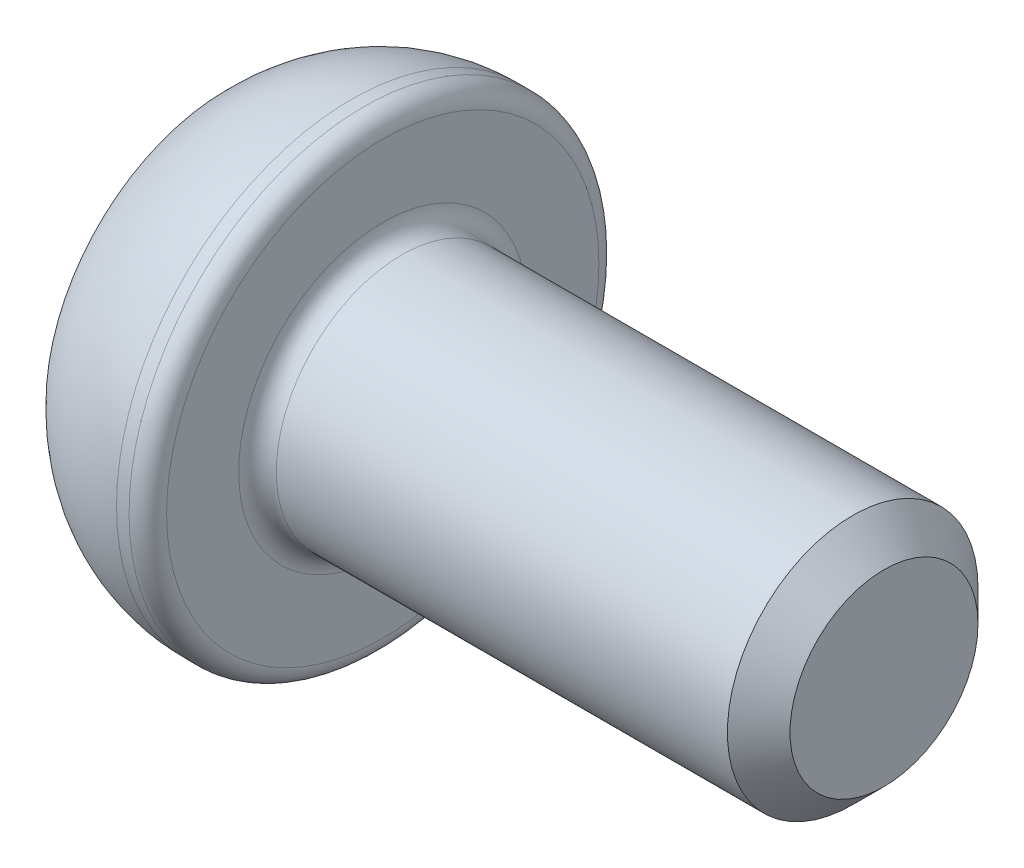
ISO-10303-21;
HEADER;
FILE_DESCRIPTION(('STEP AP214'),'2;1');
FILE_NAME('part.step','',(''),(''),'','','');
FILE_SCHEMA(('AUTOMOTIVE_DESIGN { 1 0 10303 214 1 1 1 1 }'));
ENDSEC;
DATA;
#1=APPLICATION_CONTEXT('core data for automotive mechanical design processes');
#2=APPLICATION_PROTOCOL_DEFINITION('international standard','automotive_design',2000,#1);
#3=PRODUCT_CONTEXT('',#1,'mechanical');
#4=PRODUCT('Part','Part','',(#3));
#5=PRODUCT_RELATED_PRODUCT_CATEGORY('part','',(#4));
#6=PRODUCT_DEFINITION_FORMATION('','',#4);
#7=PRODUCT_DEFINITION_CONTEXT('part definition',#1,'design');
#8=PRODUCT_DEFINITION('design','',#6,#7);
#9=PRODUCT_DEFINITION_SHAPE('','',#8);
#10=(LENGTH_UNIT() NAMED_UNIT(*) SI_UNIT(.MILLI.,.METRE.));
#11=(NAMED_UNIT(*) PLANE_ANGLE_UNIT() SI_UNIT($,.RADIAN.));
#12=(NAMED_UNIT(*) SI_UNIT($,.STERADIAN.) SOLID_ANGLE_UNIT());
#13=UNCERTAINTY_MEASURE_WITH_UNIT(LENGTH_MEASURE(1.E-05),#10,'distance_accuracy_value','');
#14=(GEOMETRIC_REPRESENTATION_CONTEXT(3) GLOBAL_UNCERTAINTY_ASSIGNED_CONTEXT((#13)) GLOBAL_UNIT_ASSIGNED_CONTEXT((#10,
#11,#12)) REPRESENTATION_CONTEXT('',''));
#15=CARTESIAN_POINT('',(0.,0.,0.));
#16=DIRECTION('',(0.,0.,1.));
#17=DIRECTION('',(1.,0.,0.));
#18=AXIS2_PLACEMENT_3D('',#15,#16,#17);
#19=CARTESIAN_POINT('',(0.,0.,0.));
#20=DIRECTION('',(-1.,0.,0.));
#21=DIRECTION('',(0.,0.,1.));
#22=AXIS2_PLACEMENT_3D('',#19,#20,#21);
#23=PLANE('',#22);
#24=DIRECTION('',(0.,0.866025403784438,-0.5));
#25=VECTOR('',#24,1.);
#26=CARTESIAN_POINT('',(0.,0.,1.44337567297407));
#27=LINE('',#26,#25);
#28=CARTESIAN_POINT('',(0.,0.,1.44337567297407));
#29=VERTEX_POINT('',#28);
#30=CARTESIAN_POINT('',(0.,1.25,0.721687836487032));
#31=VERTEX_POINT('',#30);
#32=EDGE_CURVE('E59',#29,#31,#27,.T.);
#33=ORIENTED_EDGE('',*,*,#32,.F.);
#34=DIRECTION('',(0.,0.866025403784438,0.5));
#35=VECTOR('',#34,1.);
#36=CARTESIAN_POINT('',(0.,-1.25,0.721687836487033));
#37=LINE('',#36,#35);
#38=CARTESIAN_POINT('',(0.,-1.25,0.721687836487033));
#39=VERTEX_POINT('',#38);
#40=EDGE_CURVE('E153',#39,#29,#37,.T.);
#41=ORIENTED_EDGE('',*,*,#40,.F.);
#42=DIRECTION('',(0.,0.,1.));
#43=VECTOR('',#42,1.);
#44=CARTESIAN_POINT('',(0.,-1.25,-0.721687836487032));
#45=LINE('',#44,#43);
#46=CARTESIAN_POINT('',(0.,-1.25,-0.721687836487032));
#47=VERTEX_POINT('',#46);
#48=EDGE_CURVE('E150',#47,#39,#45,.T.);
#49=ORIENTED_EDGE('',*,*,#48,.F.);
#50=DIRECTION('',(0.,-0.866025403784438,0.5));
#51=VECTOR('',#50,1.);
#52=CARTESIAN_POINT('',(0.,0.,-1.44337567297407));
#53=LINE('',#52,#51);
#54=CARTESIAN_POINT('',(0.,0.,-1.44337567297407));
#55=VERTEX_POINT('',#54);
#56=EDGE_CURVE('E107',#55,#47,#53,.T.);
#57=ORIENTED_EDGE('',*,*,#56,.F.);
#58=DIRECTION('',(0.,-0.866025403784438,-0.5));
#59=VECTOR('',#58,1.);
#60=CARTESIAN_POINT('',(0.,1.25,-0.721687836487032));
#61=LINE('',#60,#59);
#62=CARTESIAN_POINT('',(0.,1.25,-0.721687836487032));
#63=VERTEX_POINT('',#62);
#64=EDGE_CURVE('E144',#63,#55,#61,.T.);
#65=ORIENTED_EDGE('',*,*,#64,.F.);
#66=DIRECTION('',(0.,0.,-1.));
#67=VECTOR('',#66,1.);
#68=CARTESIAN_POINT('',(0.,1.25,0.721687836487032));
#69=LINE('',#68,#67);
#70=EDGE_CURVE('E140',#31,#63,#69,.T.);
#71=ORIENTED_EDGE('',*,*,#70,.F.);
#72=EDGE_LOOP('',(#33,#41,#49,#57,#65,#71));
#73=FACE_BOUND('',#72,.T.);
#74=CARTESIAN_POINT('',(0.,0.,0.));
#75=DIRECTION('',(1.,0.,0.));
#76=DIRECTION('',(0.,0.,-1.));
#77=AXIS2_PLACEMENT_3D('',#74,#75,#76);
#78=CIRCLE('',#77,2.875);
#79=CARTESIAN_POINT('',(0.,0.,-2.875));
#80=VERTEX_POINT('',#79);
#81=EDGE_CURVE('E172',#80,#80,#78,.T.);
#82=ORIENTED_EDGE('',*,*,#81,.F.);
#83=EDGE_LOOP('',(#82));
#84=FACE_BOUND('',#83,.T.);
#85=ADVANCED_FACE('F42',(#73,#84),#23,.T.);
#86=CARTESIAN_POINT('',(2.,0.,0.));
#87=DIRECTION('',(1.,0.,0.));
#88=DIRECTION('',(0.,0.,-1.));
#89=AXIS2_PLACEMENT_3D('',#86,#87,#88);
#90=DEGENERATE_TOROIDAL_SURFACE('',#89,1.02678571428571,2.72321428571429,.T.);
#91=ORIENTED_EDGE('',*,*,#81,.T.);
#92=EDGE_LOOP('',(#91));
#93=FACE_BOUND('',#92,.T.);
#94=CARTESIAN_POINT('',(2.,0.,0.));
#95=DIRECTION('',(1.,0.,0.));
#96=DIRECTION('',(0.,0.,-1.));
#97=AXIS2_PLACEMENT_3D('',#94,#95,#96);
#98=CIRCLE('',#97,3.75);
#99=CARTESIAN_POINT('',(2.,0.,-3.75));
#100=VERTEX_POINT('',#99);
#101=EDGE_CURVE('E159',#100,#100,#98,.T.);
#102=ORIENTED_EDGE('',*,*,#101,.F.);
#103=EDGE_LOOP('',(#102));
#104=FACE_BOUND('',#103,.T.);
#105=ADVANCED_FACE('F208',(#93,#104),#90,.T.);
#106=CARTESIAN_POINT('',(10.5,0.,0.));
#107=DIRECTION('',(1.,0.,0.));
#108=DIRECTION('',(0.,0.,-1.));
#109=AXIS2_PLACEMENT_3D('',#106,#107,#108);
#110=CYLINDRICAL_SURFACE('',#109,3.75);
#111=CARTESIAN_POINT('',(2.2,0.,0.));
#112=DIRECTION('',(1.,0.,0.));
#113=DIRECTION('',(0.,0.,-1.));
#114=AXIS2_PLACEMENT_3D('',#111,#112,#113);
#115=CIRCLE('',#114,3.75);
#116=CARTESIAN_POINT('',(2.2,0.,-3.75));
#117=VERTEX_POINT('',#116);
#118=EDGE_CURVE('E188',#117,#117,#115,.F.);
#119=ORIENTED_EDGE('',*,*,#118,.T.);
#120=EDGE_LOOP('',(#119));
#121=FACE_BOUND('',#120,.T.);
#122=ORIENTED_EDGE('',*,*,#101,.T.);
#123=EDGE_LOOP('',(#122));
#124=FACE_BOUND('',#123,.T.);
#125=ADVANCED_FACE('F214',(#121,#124),#110,.T.);
#126=CARTESIAN_POINT('',(2.5,3.75,0.));
#127=DIRECTION('',(1.,0.,0.));
#128=DIRECTION('',(0.,0.,-1.));
#129=AXIS2_PLACEMENT_3D('',#126,#127,#128);
#130=PLANE('',#129);
#131=CARTESIAN_POINT('',(2.5,0.,0.));
#132=DIRECTION('',(1.,0.,0.));
#133=DIRECTION('',(0.,0.,-1.));
#134=AXIS2_PLACEMENT_3D('',#131,#132,#133);
#135=CIRCLE('',#134,2.3);
#136=CARTESIAN_POINT('',(2.5,0.,-2.3));
#137=VERTEX_POINT('',#136);
#138=EDGE_CURVE('E184',#137,#137,#135,.F.);
#139=ORIENTED_EDGE('',*,*,#138,.T.);
#140=EDGE_LOOP('',(#139));
#141=FACE_BOUND('',#140,.T.);
#142=CARTESIAN_POINT('',(2.5,0.,0.));
#143=DIRECTION('',(1.,0.,0.));
#144=DIRECTION('',(0.,0.,-1.));
#145=AXIS2_PLACEMENT_3D('',#142,#143,#144);
#146=CIRCLE('',#145,3.45);
#147=CARTESIAN_POINT('',(2.5,0.,-3.45));
#148=VERTEX_POINT('',#147);
#149=EDGE_CURVE('E180',#148,#148,#146,.T.);
#150=ORIENTED_EDGE('',*,*,#149,.T.);
#151=EDGE_LOOP('',(#150));
#152=FACE_BOUND('',#151,.T.);
#153=ADVANCED_FACE('F233',(#141,#152),#130,.T.);
#154=CARTESIAN_POINT('',(10.5,0.,0.));
#155=DIRECTION('',(1.,0.,0.));
#156=DIRECTION('',(0.,0.,-1.));
#157=AXIS2_PLACEMENT_3D('',#154,#155,#156);
#158=CYLINDRICAL_SURFACE('',#157,2.);
#159=CARTESIAN_POINT('',(10.,0.,0.));
#160=DIRECTION('',(1.,0.,0.));
#161=DIRECTION('',(0.,0.,-1.));
#162=AXIS2_PLACEMENT_3D('',#159,#160,#161);
#163=CIRCLE('',#162,2.);
#164=CARTESIAN_POINT('',(10.,0.,-2.));
#165=VERTEX_POINT('',#164);
#166=EDGE_CURVE('E11',#165,#165,#163,.F.);
#167=ORIENTED_EDGE('',*,*,#166,.T.);
#168=EDGE_LOOP('',(#167));
#169=FACE_BOUND('',#168,.T.);
#170=CARTESIAN_POINT('',(2.8,0.,0.));
#171=DIRECTION('',(1.,0.,0.));
#172=DIRECTION('',(0.,0.,-1.));
#173=AXIS2_PLACEMENT_3D('',#170,#171,#172);
#174=CIRCLE('',#173,2.);
#175=CARTESIAN_POINT('',(2.8,0.,-2.));
#176=VERTEX_POINT('',#175);
#177=EDGE_CURVE('E176',#176,#176,#174,.T.);
#178=ORIENTED_EDGE('',*,*,#177,.T.);
#179=EDGE_LOOP('',(#178));
#180=FACE_BOUND('',#179,.T.);
#181=ADVANCED_FACE('F231',(#169,#180),#158,.T.);
#182=CARTESIAN_POINT('',(10.5,2.,0.));
#183=DIRECTION('',(1.,0.,0.));
#184=DIRECTION('',(0.,0.,-1.));
#185=AXIS2_PLACEMENT_3D('',#182,#183,#184);
#186=PLANE('',#185);
#187=CARTESIAN_POINT('',(10.5,0.,0.));
#188=DIRECTION('',(1.,0.,0.));
#189=DIRECTION('',(0.,0.,-1.));
#190=AXIS2_PLACEMENT_3D('',#187,#188,#189);
#191=CIRCLE('',#190,1.5);
#192=CARTESIAN_POINT('',(10.5,0.,-1.5));
#193=VERTEX_POINT('',#192);
#194=EDGE_CURVE('E52',#193,#193,#191,.T.);
#195=ORIENTED_EDGE('',*,*,#194,.T.);
#196=EDGE_LOOP('',(#195));
#197=FACE_BOUND('',#196,.T.);
#198=ADVANCED_FACE('F196',(#197),#186,.T.);
#199=CARTESIAN_POINT('',(1.5,0.,1.44337567297407));
#200=DIRECTION('',(0.,0.5,0.866025403784438));
#201=DIRECTION('',(0.,-0.866025403784439,0.5));
#202=AXIS2_PLACEMENT_3D('',#199,#200,#201);
#203=PLANE('',#202);
#204=ORIENTED_EDGE('',*,*,#32,.T.);
#205=DIRECTION('',(-1.,0.,0.));
#206=VECTOR('',#205,1.);
#207=CARTESIAN_POINT('',(1.5,1.25,0.721687836487032));
#208=LINE('',#207,#206);
#209=CARTESIAN_POINT('',(1.5,1.25,0.721687836487032));
#210=VERTEX_POINT('',#209);
#211=EDGE_CURVE('E89',#210,#31,#208,.T.);
#212=ORIENTED_EDGE('',*,*,#211,.F.);
#213=DIRECTION('',(0.,0.866025403784438,-0.5));
#214=VECTOR('',#213,1.);
#215=CARTESIAN_POINT('',(1.5,0.,1.44337567297407));
#216=LINE('',#215,#214);
#217=CARTESIAN_POINT('',(1.5,0.,1.44337567297407));
#218=VERTEX_POINT('',#217);
#219=EDGE_CURVE('E156',#218,#210,#216,.T.);
#220=ORIENTED_EDGE('',*,*,#219,.F.);
#221=DIRECTION('',(-1.,0.,0.));
#222=VECTOR('',#221,1.);
#223=CARTESIAN_POINT('',(1.5,0.,1.44337567297407));
#224=LINE('',#223,#222);
#225=EDGE_CURVE('E67',#218,#29,#224,.T.);
#226=ORIENTED_EDGE('',*,*,#225,.T.);
#227=EDGE_LOOP('',(#204,#212,#220,#226));
#228=FACE_BOUND('',#227,.T.);
#229=ADVANCED_FACE('F240',(#228),#203,.F.);
#230=CARTESIAN_POINT('',(1.5,-1.25,0.721687836487033));
#231=DIRECTION('',(0.,-0.5,0.866025403784439));
#232=DIRECTION('',(0.,-0.866025403784439,-0.5));
#233=AXIS2_PLACEMENT_3D('',#230,#231,#232);
#234=PLANE('',#233);
#235=ORIENTED_EDGE('',*,*,#40,.T.);
#236=ORIENTED_EDGE('',*,*,#225,.F.);
#237=DIRECTION('',(0.,0.866025403784438,0.5));
#238=VECTOR('',#237,1.);
#239=CARTESIAN_POINT('',(1.5,-1.25,0.721687836487033));
#240=LINE('',#239,#238);
#241=CARTESIAN_POINT('',(1.5,-1.25,0.721687836487033));
#242=VERTEX_POINT('',#241);
#243=EDGE_CURVE('E121',#242,#218,#240,.T.);
#244=ORIENTED_EDGE('',*,*,#243,.F.);
#245=DIRECTION('',(-1.,0.,0.));
#246=VECTOR('',#245,1.);
#247=CARTESIAN_POINT('',(1.5,-1.25,0.721687836487033));
#248=LINE('',#247,#246);
#249=EDGE_CURVE('E112',#242,#39,#248,.T.);
#250=ORIENTED_EDGE('',*,*,#249,.T.);
#251=EDGE_LOOP('',(#235,#236,#244,#250));
#252=FACE_BOUND('',#251,.T.);
#253=ADVANCED_FACE('F283',(#252),#234,.F.);
#254=CARTESIAN_POINT('',(1.5,-1.25,-0.721687836487032));
#255=DIRECTION('',(0.,-1.,0.));
#256=DIRECTION('',(0.,0.,-1.));
#257=AXIS2_PLACEMENT_3D('',#254,#255,#256);
#258=PLANE('',#257);
#259=ORIENTED_EDGE('',*,*,#48,.T.);
#260=ORIENTED_EDGE('',*,*,#249,.F.);
#261=DIRECTION('',(0.,0.,1.));
#262=VECTOR('',#261,1.);
#263=CARTESIAN_POINT('',(1.5,-1.25,-0.721687836487032));
#264=LINE('',#263,#262);
#265=CARTESIAN_POINT('',(1.5,-1.25,-0.721687836487032));
#266=VERTEX_POINT('',#265);
#267=EDGE_CURVE('E116',#266,#242,#264,.T.);
#268=ORIENTED_EDGE('',*,*,#267,.F.);
#269=DIRECTION('',(-1.,0.,0.));
#270=VECTOR('',#269,1.);
#271=CARTESIAN_POINT('',(1.5,-1.25,-0.721687836487032));
#272=LINE('',#271,#270);
#273=EDGE_CURVE('E100',#266,#47,#272,.T.);
#274=ORIENTED_EDGE('',*,*,#273,.T.);
#275=EDGE_LOOP('',(#259,#260,#268,#274));
#276=FACE_BOUND('',#275,.T.);
#277=ADVANCED_FACE('F117',(#276),#258,.F.);
#278=CARTESIAN_POINT('',(1.5,0.,-1.44337567297407));
#279=DIRECTION('',(0.,-0.5,-0.866025403784439));
#280=DIRECTION('',(0.,0.866025403784439,-0.5));
#281=AXIS2_PLACEMENT_3D('',#278,#279,#280);
#282=PLANE('',#281);
#283=ORIENTED_EDGE('',*,*,#56,.T.);
#284=ORIENTED_EDGE('',*,*,#273,.F.);
#285=DIRECTION('',(0.,-0.866025403784438,0.5));
#286=VECTOR('',#285,1.);
#287=CARTESIAN_POINT('',(1.5,0.,-1.44337567297407));
#288=LINE('',#287,#286);
#289=CARTESIAN_POINT('',(1.5,0.,-1.44337567297407));
#290=VERTEX_POINT('',#289);
#291=EDGE_CURVE('E104',#290,#266,#288,.T.);
#292=ORIENTED_EDGE('',*,*,#291,.F.);
#293=DIRECTION('',(-1.,0.,0.));
#294=VECTOR('',#293,1.);
#295=CARTESIAN_POINT('',(1.5,0.,-1.44337567297407));
#296=LINE('',#295,#294);
#297=EDGE_CURVE('E113',#290,#55,#296,.T.);
#298=ORIENTED_EDGE('',*,*,#297,.T.);
#299=EDGE_LOOP('',(#283,#284,#292,#298));
#300=FACE_BOUND('',#299,.T.);
#301=ADVANCED_FACE('F102',(#300),#282,.F.);
#302=CARTESIAN_POINT('',(1.5,1.25,-0.721687836487032));
#303=DIRECTION('',(0.,0.5,-0.866025403784438));
#304=DIRECTION('',(0.,0.866025403784439,0.5));
#305=AXIS2_PLACEMENT_3D('',#302,#303,#304);
#306=PLANE('',#305);
#307=ORIENTED_EDGE('',*,*,#64,.T.);
#308=ORIENTED_EDGE('',*,*,#297,.F.);
#309=DIRECTION('',(0.,-0.866025403784438,-0.5));
#310=VECTOR('',#309,1.);
#311=CARTESIAN_POINT('',(1.5,1.25,-0.721687836487032));
#312=LINE('',#311,#310);
#313=CARTESIAN_POINT('',(1.5,1.25,-0.721687836487032));
#314=VERTEX_POINT('',#313);
#315=EDGE_CURVE('E127',#314,#290,#312,.T.);
#316=ORIENTED_EDGE('',*,*,#315,.F.);
#317=DIRECTION('',(-1.,0.,0.));
#318=VECTOR('',#317,1.);
#319=CARTESIAN_POINT('',(1.5,1.25,-0.721687836487032));
#320=LINE('',#319,#318);
#321=EDGE_CURVE('E164',#314,#63,#320,.T.);
#322=ORIENTED_EDGE('',*,*,#321,.T.);
#323=EDGE_LOOP('',(#307,#308,#316,#322));
#324=FACE_BOUND('',#323,.T.);
#325=ADVANCED_FACE('F308',(#324),#306,.F.);
#326=CARTESIAN_POINT('',(1.5,1.25,0.721687836487032));
#327=DIRECTION('',(0.,1.,0.));
#328=DIRECTION('',(0.,0.,1.));
#329=AXIS2_PLACEMENT_3D('',#326,#327,#328);
#330=PLANE('',#329);
#331=ORIENTED_EDGE('',*,*,#70,.T.);
#332=ORIENTED_EDGE('',*,*,#321,.F.);
#333=DIRECTION('',(0.,0.,-1.));
#334=VECTOR('',#333,1.);
#335=CARTESIAN_POINT('',(1.5,1.25,0.721687836487032));
#336=LINE('',#335,#334);
#337=EDGE_CURVE('E132',#210,#314,#336,.T.);
#338=ORIENTED_EDGE('',*,*,#337,.F.);
#339=ORIENTED_EDGE('',*,*,#211,.T.);
#340=EDGE_LOOP('',(#331,#332,#338,#339));
#341=FACE_BOUND('',#340,.T.);
#342=ADVANCED_FACE('F225',(#341),#330,.F.);
#343=CARTESIAN_POINT('',(1.5,0.,0.));
#344=DIRECTION('',(-1.,0.,0.));
#345=DIRECTION('',(0.,0.,1.));
#346=AXIS2_PLACEMENT_3D('',#343,#344,#345);
#347=PLANE('',#346);
#348=ORIENTED_EDGE('',*,*,#219,.T.);
#349=ORIENTED_EDGE('',*,*,#337,.T.);
#350=ORIENTED_EDGE('',*,*,#315,.T.);
#351=ORIENTED_EDGE('',*,*,#291,.T.);
#352=ORIENTED_EDGE('',*,*,#267,.T.);
#353=ORIENTED_EDGE('',*,*,#243,.T.);
#354=EDGE_LOOP('',(#348,#349,#350,#351,#352,#353));
#355=FACE_BOUND('',#354,.T.);
#356=ADVANCED_FACE('F124',(#355),#347,.T.);
#357=CARTESIAN_POINT('',(2.8,0.,0.));
#358=DIRECTION('',(1.,0.,0.));
#359=DIRECTION('',(0.,0.,-1.));
#360=AXIS2_PLACEMENT_3D('',#357,#358,#359);
#361=TOROIDAL_SURFACE('',#360,2.3,0.3);
#362=ORIENTED_EDGE('',*,*,#138,.F.);
#363=EDGE_LOOP('',(#362));
#364=FACE_BOUND('',#363,.T.);
#365=ORIENTED_EDGE('',*,*,#177,.F.);
#366=EDGE_LOOP('',(#365));
#367=FACE_BOUND('',#366,.T.);
#368=ADVANCED_FACE('F204',(#364,#367),#361,.F.);
#369=CARTESIAN_POINT('',(2.2,0.,0.));
#370=DIRECTION('',(1.,0.,0.));
#371=DIRECTION('',(0.,0.,-1.));
#372=AXIS2_PLACEMENT_3D('',#369,#370,#371);
#373=TOROIDAL_SURFACE('',#372,3.45,0.3);
#374=ORIENTED_EDGE('',*,*,#118,.F.);
#375=EDGE_LOOP('',(#374));
#376=FACE_BOUND('',#375,.T.);
#377=ORIENTED_EDGE('',*,*,#149,.F.);
#378=EDGE_LOOP('',(#377));
#379=FACE_BOUND('',#378,.T.);
#380=ADVANCED_FACE('F199',(#376,#379),#373,.T.);
#381=CARTESIAN_POINT('',(10.5,0.,0.));
#382=DIRECTION('',(-1.,0.,0.));
#383=DIRECTION('',(0.,0.,1.));
#384=AXIS2_PLACEMENT_3D('',#381,#382,#383);
#385=CONICAL_SURFACE('',#384,1.5,0.785398163397447);
#386=ORIENTED_EDGE('',*,*,#166,.F.);
#387=EDGE_LOOP('',(#386));
#388=FACE_BOUND('',#387,.T.);
#389=ORIENTED_EDGE('',*,*,#194,.F.);
#390=EDGE_LOOP('',(#389));
#391=FACE_BOUND('',#390,.T.);
#392=ADVANCED_FACE('F45',(#388,#391),#385,.T.);
#393=CLOSED_SHELL('',(#85,#105,#125,#153,#181,#198,#229,#253,#277,#301,#325,#342,#356,#368,#380,#392));
#394=MANIFOLD_SOLID_BREP('B2',#393);
#395=ADVANCED_BREP_SHAPE_REPRESENTATION('',(#18,#394),#14);
#396=SHAPE_DEFINITION_REPRESENTATION(#9,#395);
ENDSEC;
END-ISO-10303-21;
